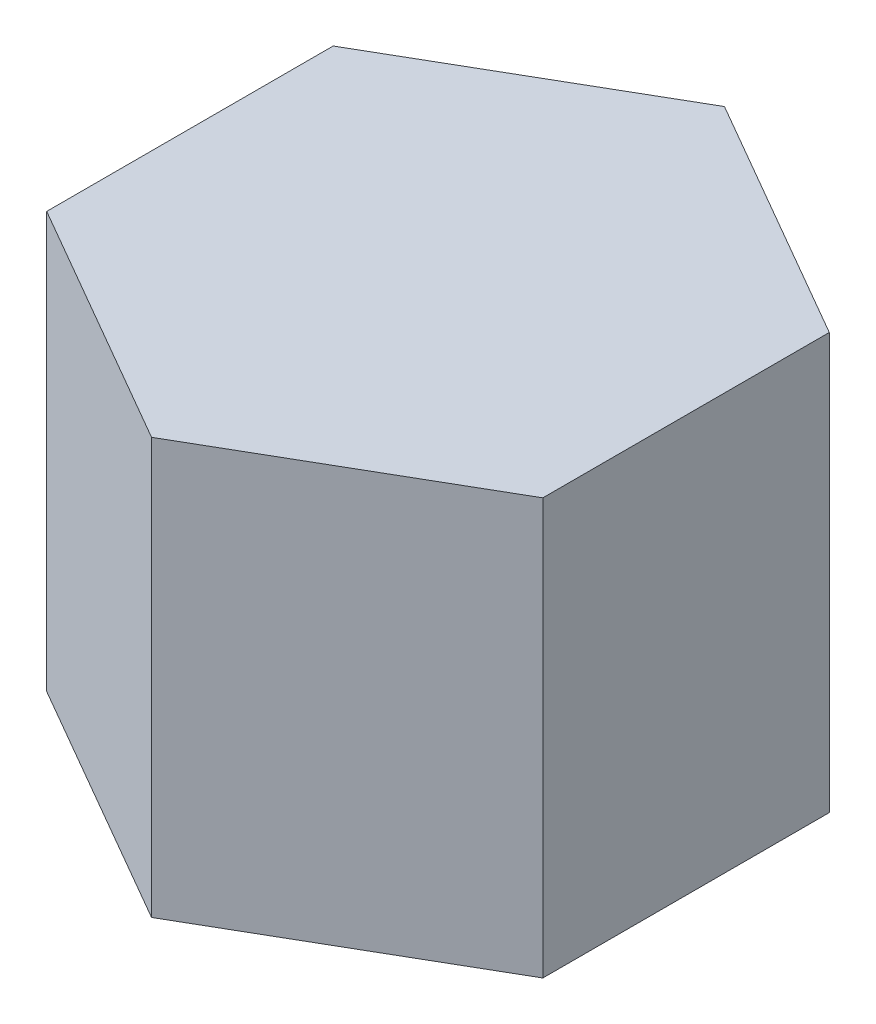
ISO-10303-21;
HEADER;
FILE_DESCRIPTION(('STEP AP214'),'2;1');
FILE_NAME('part.step','',(''),(''),'','','');
FILE_SCHEMA(('AUTOMOTIVE_DESIGN { 1 0 10303 214 1 1 1 1 }'));
ENDSEC;
DATA;
#1=APPLICATION_CONTEXT('core data for automotive mechanical design processes');
#2=APPLICATION_PROTOCOL_DEFINITION('international standard','automotive_design',2000,#1);
#3=PRODUCT_CONTEXT('',#1,'mechanical');
#4=PRODUCT('Part','Part','',(#3));
#5=PRODUCT_RELATED_PRODUCT_CATEGORY('part','',(#4));
#6=PRODUCT_DEFINITION_FORMATION('','',#4);
#7=PRODUCT_DEFINITION_CONTEXT('part definition',#1,'design');
#8=PRODUCT_DEFINITION('design','',#6,#7);
#9=PRODUCT_DEFINITION_SHAPE('','',#8);
#10=(LENGTH_UNIT() NAMED_UNIT(*) SI_UNIT(.MILLI.,.METRE.));
#11=(NAMED_UNIT(*) PLANE_ANGLE_UNIT() SI_UNIT($,.RADIAN.));
#12=(NAMED_UNIT(*) SI_UNIT($,.STERADIAN.) SOLID_ANGLE_UNIT());
#13=UNCERTAINTY_MEASURE_WITH_UNIT(LENGTH_MEASURE(1.E-05),#10,'distance_accuracy_value','');
#14=(GEOMETRIC_REPRESENTATION_CONTEXT(3) GLOBAL_UNCERTAINTY_ASSIGNED_CONTEXT((#13)) GLOBAL_UNIT_ASSIGNED_CONTEXT((#10,
#11,#12)) REPRESENTATION_CONTEXT('',''));
#15=CARTESIAN_POINT('',(0.,0.,0.));
#16=DIRECTION('',(0.,0.,1.));
#17=DIRECTION('',(1.,0.,0.));
#18=AXIS2_PLACEMENT_3D('',#15,#16,#17);
#19=CARTESIAN_POINT('',(209.642660308706,-148.537700895744,291.506971220494));
#20=DIRECTION('',(-0.499999999999909,0.,-0.866025403784491));
#21=DIRECTION('',(-0.866025403784491,0.,0.499999999999909));
#22=AXIS2_PLACEMENT_3D('',#19,#20,#21);
#23=PLANE('',#22);
#24=CARTESIAN_POINT('',(209.339551417382,-149.045793579175,291.681971220494));
#25=DIRECTION('',(0.866025403784491,0.,-0.499999999999909));
#26=VECTOR('',#25,1.);
#27=LINE('',#24,#26);
#28=CARTESIAN_POINT('',(209.339551417382,-149.045793579175,291.681971220494));
#29=VERTEX_POINT('',#28);
#30=CARTESIAN_POINT('',(209.642660308706,-149.045793579175,291.506971220494));
#31=VERTEX_POINT('',#30);
#32=EDGE_CURVE('E170',#29,#31,#27,.T.);
#33=ORIENTED_EDGE('',*,*,#32,.T.);
#34=CARTESIAN_POINT('',(209.642660308706,-148.537700895744,291.506971220494));
#35=DIRECTION('',(0.,-1.,0.));
#36=VECTOR('',#35,1.);
#37=LINE('',#34,#36);
#38=CARTESIAN_POINT('',(209.642660308706,-148.537700895744,291.506971220494));
#39=VERTEX_POINT('',#38);
#40=EDGE_CURVE('E35',#39,#31,#37,.T.);
#41=ORIENTED_EDGE('',*,*,#40,.F.);
#42=CARTESIAN_POINT('',(209.339551417382,-148.537700895744,291.681971220494));
#43=DIRECTION('',(0.866025403784491,0.,-0.499999999999909));
#44=VECTOR('',#43,1.);
#45=LINE('',#42,#44);
#46=CARTESIAN_POINT('',(209.339551417382,-148.537700895744,291.681971220494));
#47=VERTEX_POINT('',#46);
#48=EDGE_CURVE('E159',#47,#39,#45,.T.);
#49=ORIENTED_EDGE('',*,*,#48,.F.);
#50=CARTESIAN_POINT('',(209.339551417382,-148.537700895744,291.681971220494));
#51=DIRECTION('',(0.,-1.,0.));
#52=VECTOR('',#51,1.);
#53=LINE('',#50,#52);
#54=EDGE_CURVE('E10',#47,#29,#53,.T.);
#55=ORIENTED_EDGE('',*,*,#54,.T.);
#56=EDGE_LOOP('',(#33,#41,#49,#55));
#57=FACE_BOUND('',#56,.T.);
#58=ADVANCED_FACE('F16',(#57),#23,.F.);
#59=CARTESIAN_POINT('',(209.339551417382,-148.537700895744,291.681971220494));
#60=DIRECTION('',(0.500000000000096,0.,-0.866025403784383));
#61=DIRECTION('',(-0.866025403784383,0.,-0.500000000000096));
#62=AXIS2_PLACEMENT_3D('',#59,#60,#61);
#63=PLANE('',#62);
#64=CARTESIAN_POINT('',(209.036442526057,-149.045793579175,291.506971220494));
#65=DIRECTION('',(0.866025403784383,0.,0.500000000000096));
#66=VECTOR('',#65,1.);
#67=LINE('',#64,#66);
#68=CARTESIAN_POINT('',(209.036442526057,-149.045793579175,291.506971220494));
#69=VERTEX_POINT('',#68);
#70=EDGE_CURVE('E167',#69,#29,#67,.T.);
#71=ORIENTED_EDGE('',*,*,#70,.T.);
#72=ORIENTED_EDGE('',*,*,#54,.F.);
#73=CARTESIAN_POINT('',(209.036442526057,-148.537700895744,291.506971220494));
#74=DIRECTION('',(0.866025403784383,0.,0.500000000000096));
#75=VECTOR('',#74,1.);
#76=LINE('',#73,#75);
#77=CARTESIAN_POINT('',(209.036442526057,-148.537700895744,291.506971220494));
#78=VERTEX_POINT('',#77);
#79=EDGE_CURVE('E156',#78,#47,#76,.T.);
#80=ORIENTED_EDGE('',*,*,#79,.F.);
#81=CARTESIAN_POINT('',(209.036442526057,-148.537700895744,291.506971220494));
#82=DIRECTION('',(0.,-1.,0.));
#83=VECTOR('',#82,1.);
#84=LINE('',#81,#83);
#85=EDGE_CURVE('E27',#78,#69,#84,.T.);
#86=ORIENTED_EDGE('',*,*,#85,.T.);
#87=EDGE_LOOP('',(#71,#72,#80,#86));
#88=FACE_BOUND('',#87,.T.);
#89=ADVANCED_FACE('F189',(#88),#63,.F.);
#90=CARTESIAN_POINT('',(209.036442526057,-148.537700895744,290.831971220494));
#91=DIRECTION('',(1.,0.,0.));
#92=DIRECTION('',(0.,1.,0.));
#93=AXIS2_PLACEMENT_3D('',#90,#91,#92);
#94=PLANE('',#93);
#95=CARTESIAN_POINT('',(209.036442526057,-149.045793579175,291.156971220494));
#96=DIRECTION('',(0.,0.,1.));
#97=VECTOR('',#96,1.);
#98=LINE('',#95,#97);
#99=CARTESIAN_POINT('',(209.036442526057,-149.045793579175,291.156971220494));
#100=VERTEX_POINT('',#99);
#101=EDGE_CURVE('E163',#100,#69,#98,.T.);
#102=ORIENTED_EDGE('',*,*,#101,.T.);
#103=ORIENTED_EDGE('',*,*,#85,.F.);
#104=CARTESIAN_POINT('',(209.036442526057,-148.537700895744,291.156971220494));
#105=DIRECTION('',(0.,0.,1.));
#106=VECTOR('',#105,1.);
#107=LINE('',#104,#106);
#108=CARTESIAN_POINT('',(209.036442526057,-148.537700895744,291.156971220494));
#109=VERTEX_POINT('',#108);
#110=EDGE_CURVE('E106',#109,#78,#107,.T.);
#111=ORIENTED_EDGE('',*,*,#110,.F.);
#112=CARTESIAN_POINT('',(209.036442526057,-148.537700895744,291.156971220494));
#113=DIRECTION('',(0.,-1.,0.));
#114=VECTOR('',#113,1.);
#115=LINE('',#112,#114);
#116=EDGE_CURVE('E94',#109,#100,#115,.T.);
#117=ORIENTED_EDGE('',*,*,#116,.T.);
#118=EDGE_LOOP('',(#102,#103,#111,#117));
#119=FACE_BOUND('',#118,.T.);
#120=ADVANCED_FACE('F198',(#119),#94,.F.);
#121=CARTESIAN_POINT('',(209.036442526057,-148.537700895744,291.156971220494));
#122=DIRECTION('',(0.499999999999943,0.,0.866025403784472));
#123=DIRECTION('',(0.866025403784472,0.,-0.499999999999943));
#124=AXIS2_PLACEMENT_3D('',#121,#122,#123);
#125=PLANE('',#124);
#126=CARTESIAN_POINT('',(209.339551417382,-149.045793579175,290.981971220494));
#127=DIRECTION('',(-0.866025403784471,0.,0.499999999999943));
#128=VECTOR('',#127,1.);
#129=LINE('',#126,#128);
#130=CARTESIAN_POINT('',(209.339551417382,-149.045793579175,290.981971220494));
#131=VERTEX_POINT('',#130);
#132=EDGE_CURVE('E162',#131,#100,#129,.T.);
#133=ORIENTED_EDGE('',*,*,#132,.T.);
#134=ORIENTED_EDGE('',*,*,#116,.F.);
#135=CARTESIAN_POINT('',(209.339551417382,-148.537700895744,290.981971220494));
#136=DIRECTION('',(-0.866025403784471,0.,0.499999999999943));
#137=VECTOR('',#136,1.);
#138=LINE('',#135,#137);
#139=CARTESIAN_POINT('',(209.339551417382,-148.537700895744,290.981971220494));
#140=VERTEX_POINT('',#139);
#141=EDGE_CURVE('E98',#140,#109,#138,.T.);
#142=ORIENTED_EDGE('',*,*,#141,.F.);
#143=CARTESIAN_POINT('',(209.339551417382,-148.537700895744,290.981971220494));
#144=DIRECTION('',(0.,-1.,0.));
#145=VECTOR('',#144,1.);
#146=LINE('',#143,#145);
#147=EDGE_CURVE('E79',#140,#131,#146,.T.);
#148=ORIENTED_EDGE('',*,*,#147,.T.);
#149=EDGE_LOOP('',(#133,#134,#142,#148));
#150=FACE_BOUND('',#149,.T.);
#151=ADVANCED_FACE('F100',(#150),#125,.F.);
#152=CARTESIAN_POINT('',(209.339551417382,-148.537700895744,290.981971220494));
#153=DIRECTION('',(-0.500000000000062,0.,0.866025403784403));
#154=DIRECTION('',(0.866025403784403,0.,0.500000000000062));
#155=AXIS2_PLACEMENT_3D('',#152,#153,#154);
#156=PLANE('',#155);
#157=CARTESIAN_POINT('',(209.642660308706,-149.045793579175,291.156971220494));
#158=DIRECTION('',(-0.866025403784403,0.,-0.500000000000062));
#159=VECTOR('',#158,1.);
#160=LINE('',#157,#159);
#161=CARTESIAN_POINT('',(209.642660308706,-149.045793579175,291.156971220494));
#162=VERTEX_POINT('',#161);
#163=EDGE_CURVE('E88',#162,#131,#160,.T.);
#164=ORIENTED_EDGE('',*,*,#163,.T.);
#165=ORIENTED_EDGE('',*,*,#147,.F.);
#166=CARTESIAN_POINT('',(209.642660308706,-148.537700895744,291.156971220494));
#167=DIRECTION('',(-0.866025403784403,0.,-0.500000000000062));
#168=VECTOR('',#167,1.);
#169=LINE('',#166,#168);
#170=CARTESIAN_POINT('',(209.642660308706,-148.537700895744,291.156971220494));
#171=VERTEX_POINT('',#170);
#172=EDGE_CURVE('E84',#171,#140,#169,.T.);
#173=ORIENTED_EDGE('',*,*,#172,.F.);
#174=CARTESIAN_POINT('',(209.642660308706,-148.537700895744,291.156971220494));
#175=DIRECTION('',(0.,-1.,0.));
#176=VECTOR('',#175,1.);
#177=LINE('',#174,#176);
#178=EDGE_CURVE('E58',#171,#162,#177,.T.);
#179=ORIENTED_EDGE('',*,*,#178,.T.);
#180=EDGE_LOOP('',(#164,#165,#173,#179));
#181=FACE_BOUND('',#180,.T.);
#182=ADVANCED_FACE('F82',(#181),#156,.F.);
#183=CARTESIAN_POINT('',(209.642660308706,-148.537700895744,290.831971220494));
#184=DIRECTION('',(-1.,0.,0.));
#185=DIRECTION('',(0.,-1.,0.));
#186=AXIS2_PLACEMENT_3D('',#183,#184,#185);
#187=PLANE('',#186);
#188=CARTESIAN_POINT('',(209.642660308706,-149.045793579175,291.506971220494));
#189=DIRECTION('',(0.,0.,-1.));
#190=VECTOR('',#189,1.);
#191=LINE('',#188,#190);
#192=EDGE_CURVE('E160',#31,#162,#191,.T.);
#193=ORIENTED_EDGE('',*,*,#192,.T.);
#194=ORIENTED_EDGE('',*,*,#178,.F.);
#195=CARTESIAN_POINT('',(209.642660308706,-148.537700895744,291.506971220494));
#196=DIRECTION('',(0.,0.,-1.));
#197=VECTOR('',#196,1.);
#198=LINE('',#195,#197);
#199=EDGE_CURVE('E112',#39,#171,#198,.T.);
#200=ORIENTED_EDGE('',*,*,#199,.F.);
#201=ORIENTED_EDGE('',*,*,#40,.T.);
#202=EDGE_LOOP('',(#193,#194,#200,#201));
#203=FACE_BOUND('',#202,.T.);
#204=ADVANCED_FACE('F131',(#203),#187,.F.);
#205=CARTESIAN_POINT('',(206.339551417382,-148.537700895744,290.831971220494));
#206=DIRECTION('',(0.,-1.,0.));
#207=DIRECTION('',(1.,0.,0.));
#208=AXIS2_PLACEMENT_3D('',#205,#206,#207);
#209=PLANE('',#208);
#210=ORIENTED_EDGE('',*,*,#48,.T.);
#211=ORIENTED_EDGE('',*,*,#199,.T.);
#212=ORIENTED_EDGE('',*,*,#172,.T.);
#213=ORIENTED_EDGE('',*,*,#141,.T.);
#214=ORIENTED_EDGE('',*,*,#110,.T.);
#215=ORIENTED_EDGE('',*,*,#79,.T.);
#216=EDGE_LOOP('',(#210,#211,#212,#213,#214,#215));
#217=FACE_BOUND('',#216,.T.);
#218=ADVANCED_FACE('F111',(#217),#209,.F.);
#219=CARTESIAN_POINT('',(206.339551417382,-149.045793579175,290.831971220494));
#220=DIRECTION('',(0.,-1.,0.));
#221=DIRECTION('',(1.,0.,0.));
#222=AXIS2_PLACEMENT_3D('',#219,#220,#221);
#223=PLANE('',#222);
#224=ORIENTED_EDGE('',*,*,#32,.F.);
#225=ORIENTED_EDGE('',*,*,#70,.F.);
#226=ORIENTED_EDGE('',*,*,#101,.F.);
#227=ORIENTED_EDGE('',*,*,#132,.F.);
#228=ORIENTED_EDGE('',*,*,#163,.F.);
#229=ORIENTED_EDGE('',*,*,#192,.F.);
#230=EDGE_LOOP('',(#224,#225,#226,#227,#228,#229));
#231=FACE_BOUND('',#230,.T.);
#232=ADVANCED_FACE('F130',(#231),#223,.T.);
#233=CLOSED_SHELL('',(#58,#89,#120,#151,#182,#204,#218,#232));
#234=MANIFOLD_SOLID_BREP('B1',#233);
#235=ADVANCED_BREP_SHAPE_REPRESENTATION('',(#18,#234),#14);
#236=SHAPE_DEFINITION_REPRESENTATION(#9,#235);
ENDSEC;
END-ISO-10303-21;
